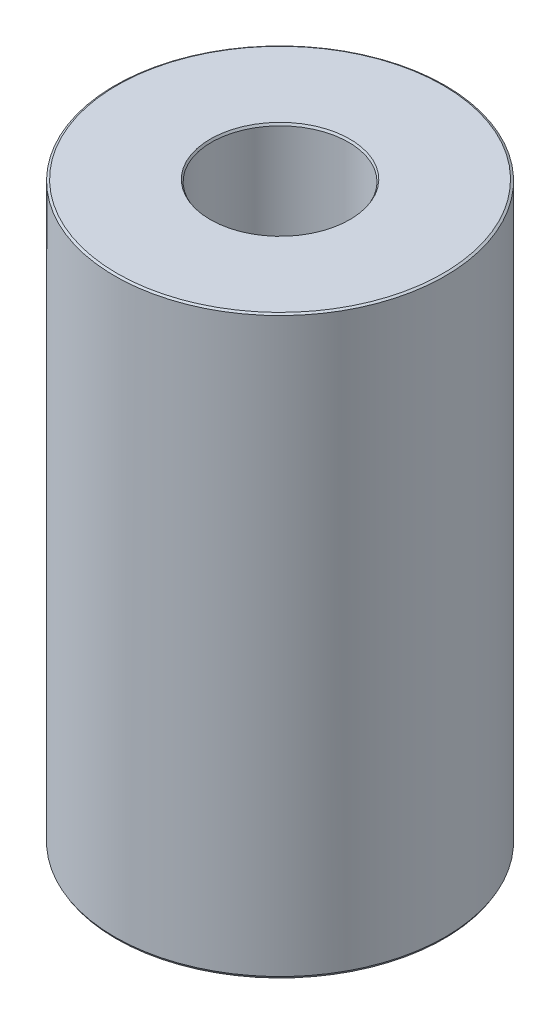
ISO-10303-21;
HEADER;
FILE_DESCRIPTION(('STEP AP214'),'2;1');
FILE_NAME('part.step','',(''),(''),'','','');
FILE_SCHEMA(('AUTOMOTIVE_DESIGN { 1 0 10303 214 1 1 1 1 }'));
ENDSEC;
DATA;
#1=APPLICATION_CONTEXT('core data for automotive mechanical design processes');
#2=APPLICATION_PROTOCOL_DEFINITION('international standard','automotive_design',2000,#1);
#3=PRODUCT_CONTEXT('',#1,'mechanical');
#4=PRODUCT('Part','Part','',(#3));
#5=PRODUCT_RELATED_PRODUCT_CATEGORY('part','',(#4));
#6=PRODUCT_DEFINITION_FORMATION('','',#4);
#7=PRODUCT_DEFINITION_CONTEXT('part definition',#1,'design');
#8=PRODUCT_DEFINITION('design','',#6,#7);
#9=PRODUCT_DEFINITION_SHAPE('','',#8);
#10=(LENGTH_UNIT() NAMED_UNIT(*) SI_UNIT(.MILLI.,.METRE.));
#11=(NAMED_UNIT(*) PLANE_ANGLE_UNIT() SI_UNIT($,.RADIAN.));
#12=(NAMED_UNIT(*) SI_UNIT($,.STERADIAN.) SOLID_ANGLE_UNIT());
#13=UNCERTAINTY_MEASURE_WITH_UNIT(LENGTH_MEASURE(1.E-05),#10,'distance_accuracy_value','');
#14=(GEOMETRIC_REPRESENTATION_CONTEXT(3) GLOBAL_UNCERTAINTY_ASSIGNED_CONTEXT((#13)) GLOBAL_UNIT_ASSIGNED_CONTEXT((#10,
#11,#12)) REPRESENTATION_CONTEXT('',''));
#15=CARTESIAN_POINT('',(0.,0.,0.));
#16=DIRECTION('',(0.,0.,1.));
#17=DIRECTION('',(1.,0.,0.));
#18=AXIS2_PLACEMENT_3D('',#15,#16,#17);
#19=CARTESIAN_POINT('',(0.,122.043287805677,0.));
#20=DIRECTION('',(0.,-1.,0.));
#21=DIRECTION('',(0.,0.,-1.));
#22=AXIS2_PLACEMENT_3D('',#19,#20,#21);
#23=CYLINDRICAL_SURFACE('',#22,35.);
#24=CARTESIAN_POINT('',(0.,0.454640372833229,0.));
#25=DIRECTION('',(0.,1.,0.));
#26=DIRECTION('',(0.,0.,1.));
#27=AXIS2_PLACEMENT_3D('',#24,#25,#26);
#28=CIRCLE('',#27,35.);
#29=CARTESIAN_POINT('',(0.,0.454640372833229,-35.));
#30=VERTEX_POINT('',#29);
#31=EDGE_CURVE('E10',#30,#30,#28,.T.);
#32=CARTESIAN_POINT('',(0.,121.780801064037,0.));
#33=DIRECTION('',(0.,1.,0.));
#34=DIRECTION('',(0.,0.,1.));
#35=AXIS2_PLACEMENT_3D('',#32,#33,#34);
#36=CIRCLE('',#35,35.);
#37=CARTESIAN_POINT('',(0.,121.780801064037,-35.));
#38=VERTEX_POINT('',#37);
#39=EDGE_CURVE('E50',#38,#38,#36,.F.);
#40=CARTESIAN_POINT('',(0.,0.454640372833229,-35.));
#41=CARTESIAN_POINT('',(0.,1.71845454669994,-35.));
#42=CARTESIAN_POINT('',(0.,2.98226872056665,-35.));
#43=CARTESIAN_POINT('',(0.,5.50989706830007,-35.));
#44=CARTESIAN_POINT('',(0.,6.77371124216678,-35.));
#45=CARTESIAN_POINT('',(0.,9.3013395899002,-35.));
#46=CARTESIAN_POINT('',(0.,10.5651537637669,-35.));
#47=CARTESIAN_POINT('',(0.,13.0927821115003,-35.));
#48=CARTESIAN_POINT('',(0.,14.356596285367,-35.));
#49=CARTESIAN_POINT('',(0.,16.8842246331005,-35.));
#50=CARTESIAN_POINT('',(0.,18.1480388069672,-35.));
#51=CARTESIAN_POINT('',(0.,20.6756671547006,-35.));
#52=CARTESIAN_POINT('',(0.,21.9394813285673,-35.));
#53=CARTESIAN_POINT('',(0.,24.4671096763007,-35.));
#54=CARTESIAN_POINT('',(0.,25.7309238501674,-35.));
#55=CARTESIAN_POINT('',(0.,28.2585521979009,-35.));
#56=CARTESIAN_POINT('',(0.,29.5223663717676,-35.));
#57=CARTESIAN_POINT('',(0.,32.049994719501,-35.));
#58=CARTESIAN_POINT('',(0.,33.3138088933677,-35.));
#59=CARTESIAN_POINT('',(0.,35.8414372411011,-35.));
#60=CARTESIAN_POINT('',(0.,37.1052514149678,-35.));
#61=CARTESIAN_POINT('',(0.,39.6328797627013,-35.));
#62=CARTESIAN_POINT('',(0.,40.896693936568,-35.));
#63=CARTESIAN_POINT('',(0.,43.4243222843014,-35.));
#64=CARTESIAN_POINT('',(0.,44.6881364581681,-35.));
#65=CARTESIAN_POINT('',(0.,47.2157648059015,-35.));
#66=CARTESIAN_POINT('',(0.,48.4795789797682,-35.));
#67=CARTESIAN_POINT('',(0.,51.0072073275017,-35.));
#68=CARTESIAN_POINT('',(0.,52.2710215013684,-35.));
#69=CARTESIAN_POINT('',(0.,54.7986498491018,-35.));
#70=CARTESIAN_POINT('',(0.,56.0624640229685,-35.));
#71=CARTESIAN_POINT('',(0.,58.5900923707019,-35.));
#72=CARTESIAN_POINT('',(0.,59.8539065445686,-35.));
#73=CARTESIAN_POINT('',(0.,62.381534892302,-35.));
#74=CARTESIAN_POINT('',(0.,63.6453490661688,-35.));
#75=CARTESIAN_POINT('',(0.,66.1729774139022,-35.));
#76=CARTESIAN_POINT('',(0.,67.4367915877689,-35.));
#77=CARTESIAN_POINT('',(0.,69.9644199355023,-35.));
#78=CARTESIAN_POINT('',(0.,71.228234109369,-35.));
#79=CARTESIAN_POINT('',(0.,73.7558624571024,-35.));
#80=CARTESIAN_POINT('',(0.,75.0196766309691,-35.));
#81=CARTESIAN_POINT('',(0.,77.5473049787026,-35.));
#82=CARTESIAN_POINT('',(0.,78.8111191525693,-35.));
#83=CARTESIAN_POINT('',(0.,81.3387475003027,-35.));
#84=CARTESIAN_POINT('',(0.,82.6025616741694,-35.));
#85=CARTESIAN_POINT('',(0.,85.1301900219028,-35.));
#86=CARTESIAN_POINT('',(0.,86.3940041957696,-35.));
#87=CARTESIAN_POINT('',(0.,88.921632543503,-35.));
#88=CARTESIAN_POINT('',(0.,90.1854467173697,-35.));
#89=CARTESIAN_POINT('',(0.,92.7130750651031,-35.));
#90=CARTESIAN_POINT('',(0.,93.9768892389698,-35.));
#91=CARTESIAN_POINT('',(0.,96.5045175867032,-35.));
#92=CARTESIAN_POINT('',(0.,97.7683317605699,-35.));
#93=CARTESIAN_POINT('',(0.,100.295960108303,-35.));
#94=CARTESIAN_POINT('',(0.,101.55977428217,-35.));
#95=CARTESIAN_POINT('',(0.,104.087402629903,-35.));
#96=CARTESIAN_POINT('',(0.,105.35121680377,-35.));
#97=CARTESIAN_POINT('',(0.,107.878845151504,-35.));
#98=CARTESIAN_POINT('',(0.,109.14265932537,-35.));
#99=CARTESIAN_POINT('',(0.,111.670287673104,-35.));
#100=CARTESIAN_POINT('',(0.,112.93410184697,-35.));
#101=CARTESIAN_POINT('',(0.,115.461730194704,-35.));
#102=CARTESIAN_POINT('',(0.,116.725544368571,-35.));
#103=CARTESIAN_POINT('',(0.,119.253172716304,-35.));
#104=CARTESIAN_POINT('',(0.,120.516986890171,-35.));
#105=CARTESIAN_POINT('',(0.,121.780801064037,-35.));
#106=B_SPLINE_CURVE_WITH_KNOTS('',3,(#40,#41,#42,#43,#44,#45,#46,#47,#48,#49,#50,#51,#52,#53,
#54,#55,#56,#57,#58,#59,#60,#61,#62,#63,#64,#65,#66,#67,#68,#69,#70,#71,#72,#73,#74,#75,#76,#77,
#78,#79,#80,#81,#82,#83,#84,#85,#86,#87,#88,#89,#90,#91,#92,#93,#94,#95,#96,#97,#98,#99,#100,
#101,#102,#103,#104,#105),.UNSPECIFIED.,.F.,.F.,(4,2,2,2,2,2,2,2,2,2,2,2,2,2,2,2,2,2,2,2,2,2,2,
2,2,2,2,2,2,2,2,2,4),(0.,3.79144252160013,7.58288504320026,11.3743275648004,15.1657700864005,
18.9572126080007,22.7486551296008,26.5400976512009,30.3315401728011,34.1229826944012,
37.9144252160013,41.7058677376015,45.4973102592016,49.2887527808017,53.0801953024018,
56.871637824002,60.6630803456021,64.4545228672022,68.2459653888024,72.0374079104025,
75.8288504320026,79.6202929536028,83.4117354752029,87.203177996803,90.9946205184032,
94.7860630400033,98.5775055616034,102.368948083204,106.160390604804,109.951833126404,
113.743275648004,117.534718169604,121.326160691204),.UNSPECIFIED.);
#107=EDGE_CURVE('BSEAM39',#30,#38,#106,.T.);
#108=ORIENTED_EDGE('',*,*,#31,.T.);
#109=ORIENTED_EDGE('',*,*,#39,.T.);
#110=ORIENTED_EDGE('',*,*,#107,.T.);
#111=ORIENTED_EDGE('',*,*,#107,.F.);
#112=EDGE_LOOP('',(#108,#110,#109,#111));
#113=FACE_BOUND('',#112,.T.);
#114=ADVANCED_FACE('F39',(#113),#23,.T.);
#115=CARTESIAN_POINT('',(0.,122.043287805677,0.));
#116=DIRECTION('',(0.,1.,0.));
#117=DIRECTION('',(0.,0.,1.));
#118=AXIS2_PLACEMENT_3D('',#115,#116,#117);
#119=PLANE('',#118);
#120=CARTESIAN_POINT('',(0.,122.043287805677,0.));
#121=DIRECTION('',(0.,1.,0.));
#122=DIRECTION('',(0.,0.,1.));
#123=AXIS2_PLACEMENT_3D('',#120,#121,#122);
#124=CIRCLE('',#123,14.7996415583158);
#125=CARTESIAN_POINT('',(0.,122.043287805677,14.7996415583158));
#126=VERTEX_POINT('',#125);
#127=EDGE_CURVE('E58',#126,#126,#124,.F.);
#128=ORIENTED_EDGE('',*,*,#127,.T.);
#129=EDGE_LOOP('',(#128));
#130=FACE_BOUND('',#129,.T.);
#131=CARTESIAN_POINT('',(0.,122.043287805677,0.));
#132=DIRECTION('',(0.,1.,0.));
#133=DIRECTION('',(0.,0.,1.));
#134=AXIS2_PLACEMENT_3D('',#131,#132,#133);
#135=CIRCLE('',#134,34.5453596271668);
#136=CARTESIAN_POINT('',(0.,122.043287805677,-34.5453596271668));
#137=VERTEX_POINT('',#136);
#138=EDGE_CURVE('E61',#137,#137,#135,.T.);
#139=ORIENTED_EDGE('',*,*,#138,.T.);
#140=EDGE_LOOP('',(#139));
#141=FACE_BOUND('',#140,.T.);
#142=ADVANCED_FACE('F88',(#130,#141),#119,.T.);
#143=CARTESIAN_POINT('',(0.,0.,0.));
#144=DIRECTION('',(0.,1.,0.));
#145=DIRECTION('',(0.,0.,1.));
#146=AXIS2_PLACEMENT_3D('',#143,#144,#145);
#147=PLANE('',#146);
#148=CARTESIAN_POINT('',(0.,0.,0.));
#149=DIRECTION('',(0.,1.,0.));
#150=DIRECTION('',(0.,0.,1.));
#151=AXIS2_PLACEMENT_3D('',#148,#149,#150);
#152=CIRCLE('',#151,14.9917951895093);
#153=CARTESIAN_POINT('',(0.,0.,14.9917951895093));
#154=VERTEX_POINT('',#153);
#155=EDGE_CURVE('E51',#154,#154,#152,.T.);
#156=ORIENTED_EDGE('',*,*,#155,.T.);
#157=EDGE_LOOP('',(#156));
#158=FACE_BOUND('',#157,.T.);
#159=CARTESIAN_POINT('',(0.,0.,0.));
#160=DIRECTION('',(0.,1.,0.));
#161=DIRECTION('',(0.,0.,1.));
#162=AXIS2_PLACEMENT_3D('',#159,#160,#161);
#163=CIRCLE('',#162,34.7375132583603);
#164=CARTESIAN_POINT('',(0.,0.,34.7375132583603));
#165=VERTEX_POINT('',#164);
#166=EDGE_CURVE('E54',#165,#165,#163,.F.);
#167=ORIENTED_EDGE('',*,*,#166,.T.);
#168=EDGE_LOOP('',(#167));
#169=FACE_BOUND('',#168,.T.);
#170=ADVANCED_FACE('F83',(#158,#169),#147,.F.);
#171=CARTESIAN_POINT('',(0.,122.043287805677,0.));
#172=DIRECTION('',(0.,-1.,0.));
#173=DIRECTION('',(0.,0.,-1.));
#174=AXIS2_PLACEMENT_3D('',#171,#172,#173);
#175=CYLINDRICAL_SURFACE('',#174,14.5371548166761);
#176=CARTESIAN_POINT('',(0.,121.588647432844,0.));
#177=DIRECTION('',(0.,1.,0.));
#178=DIRECTION('',(0.,0.,1.));
#179=AXIS2_PLACEMENT_3D('',#176,#177,#178);
#180=CIRCLE('',#179,14.5371548166761);
#181=CARTESIAN_POINT('',(0.,121.588647432844,14.5371548166761));
#182=VERTEX_POINT('',#181);
#183=EDGE_CURVE('E67',#182,#182,#180,.T.);
#184=ORIENTED_EDGE('',*,*,#183,.T.);
#185=EDGE_LOOP('',(#184));
#186=FACE_BOUND('',#185,.T.);
#187=CARTESIAN_POINT('',(0.,0.26248674163977,0.));
#188=DIRECTION('',(0.,1.,0.));
#189=DIRECTION('',(0.,0.,1.));
#190=AXIS2_PLACEMENT_3D('',#187,#188,#189);
#191=CIRCLE('',#190,14.5371548166761);
#192=CARTESIAN_POINT('',(0.,0.26248674163977,14.5371548166761));
#193=VERTEX_POINT('',#192);
#194=EDGE_CURVE('E69',#193,#193,#191,.F.);
#195=ORIENTED_EDGE('',*,*,#194,.T.);
#196=EDGE_LOOP('',(#195));
#197=FACE_BOUND('',#196,.T.);
#198=ADVANCED_FACE('F71',(#186,#197),#175,.F.);
#199=CARTESIAN_POINT('',(0.,121.588647432844,0.));
#200=DIRECTION('',(0.,1.,0.));
#201=DIRECTION('',(0.,0.,1.));
#202=AXIS2_PLACEMENT_3D('',#199,#200,#201);
#203=CONICAL_SURFACE('',#202,14.5371548166761,0.523598775598273);
#204=ORIENTED_EDGE('',*,*,#127,.F.);
#205=EDGE_LOOP('',(#204));
#206=FACE_BOUND('',#205,.T.);
#207=ORIENTED_EDGE('',*,*,#183,.F.);
#208=EDGE_LOOP('',(#207));
#209=FACE_BOUND('',#208,.T.);
#210=ADVANCED_FACE('F77',(#206,#209),#203,.F.);
#211=CARTESIAN_POINT('',(0.,0.,0.));
#212=DIRECTION('',(0.,-1.,0.));
#213=DIRECTION('',(0.,0.,-1.));
#214=AXIS2_PLACEMENT_3D('',#211,#212,#213);
#215=CONICAL_SURFACE('',#214,14.9917951895093,1.0471975511966);
#216=ORIENTED_EDGE('',*,*,#194,.F.);
#217=EDGE_LOOP('',(#216));
#218=FACE_BOUND('',#217,.T.);
#219=ORIENTED_EDGE('',*,*,#155,.F.);
#220=EDGE_LOOP('',(#219));
#221=FACE_BOUND('',#220,.T.);
#222=ADVANCED_FACE('F73',(#218,#221),#215,.F.);
#223=CARTESIAN_POINT('',(0.,0.454640372833229,0.));
#224=DIRECTION('',(0.,1.,0.));
#225=DIRECTION('',(0.,0.,1.));
#226=AXIS2_PLACEMENT_3D('',#223,#224,#225);
#227=CONICAL_SURFACE('',#226,35.,0.523598775598296);
#228=ORIENTED_EDGE('',*,*,#166,.F.);
#229=EDGE_LOOP('',(#228));
#230=FACE_BOUND('',#229,.T.);
#231=ORIENTED_EDGE('',*,*,#31,.F.);
#232=EDGE_LOOP('',(#231));
#233=FACE_BOUND('',#232,.T.);
#234=ADVANCED_FACE('F76',(#230,#233),#227,.T.);
#235=CARTESIAN_POINT('',(0.,122.043287805677,0.));
#236=DIRECTION('',(0.,-1.,0.));
#237=DIRECTION('',(0.,0.,-1.));
#238=AXIS2_PLACEMENT_3D('',#235,#236,#237);
#239=CONICAL_SURFACE('',#238,34.5453596271668,1.04719755119663);
#240=CARTESIAN_POINT('',(0.,121.780801064037,-35.));
#241=CARTESIAN_POINT('',(0.,121.78353530093,-34.995264162783));
#242=CARTESIAN_POINT('',(0.,121.786269537822,-34.990528325566));
#243=CARTESIAN_POINT('',(0.,121.791738011606,-34.981056651132));
#244=CARTESIAN_POINT('',(0.,121.794472248498,-34.976320813915));
#245=CARTESIAN_POINT('',(0.,121.799940722282,-34.9668491394809));
#246=CARTESIAN_POINT('',(0.,121.802674959174,-34.9621133022639));
#247=CARTESIAN_POINT('',(0.,121.808143432958,-34.9526416278299));
#248=CARTESIAN_POINT('',(0.,121.81087766985,-34.9479057906129));
#249=CARTESIAN_POINT('',(0.,121.816346143634,-34.9384341161789));
#250=CARTESIAN_POINT('',(0.,121.819080380527,-34.9336982789618));
#251=CARTESIAN_POINT('',(0.,121.824548854311,-34.9242266045278));
#252=CARTESIAN_POINT('',(0.,121.827283091203,-34.9194907673108));
#253=CARTESIAN_POINT('',(0.,121.832751564987,-34.9100190928768));
#254=CARTESIAN_POINT('',(0.,121.835485801879,-34.9052832556598));
#255=CARTESIAN_POINT('',(0.,121.840954275663,-34.8958115812257));
#256=CARTESIAN_POINT('',(0.,121.843688512555,-34.8910757440087));
#257=CARTESIAN_POINT('',(0.,121.849156986339,-34.8816040695747));
#258=CARTESIAN_POINT('',(0.,121.851891223232,-34.8768682323577));
#259=CARTESIAN_POINT('',(0.,121.857359697016,-34.8673965579237));
#260=CARTESIAN_POINT('',(0.,121.860093933908,-34.8626607207066));
#261=CARTESIAN_POINT('',(0.,121.865562407692,-34.8531890462726));
#262=CARTESIAN_POINT('',(0.,121.868296644584,-34.8484532090556));
#263=CARTESIAN_POINT('',(0.,121.873765118368,-34.8389815346216));
#264=CARTESIAN_POINT('',(0.,121.87649935526,-34.8342456974046));
#265=CARTESIAN_POINT('',(0.,121.881967829044,-34.8247740229705));
#266=CARTESIAN_POINT('',(0.,121.884702065937,-34.8200381857535));
#267=CARTESIAN_POINT('',(0.,121.890170539721,-34.8105665113195));
#268=CARTESIAN_POINT('',(0.,121.892904776613,-34.8058306741025));
#269=CARTESIAN_POINT('',(0.,121.898373250397,-34.7963589996685));
#270=CARTESIAN_POINT('',(0.,121.901107487289,-34.7916231624515));
#271=CARTESIAN_POINT('',(0.,121.906575961073,-34.7821514880174));
#272=CARTESIAN_POINT('',(0.,121.909310197965,-34.7774156508004));
#273=CARTESIAN_POINT('',(0.,121.914778671749,-34.7679439763664));
#274=CARTESIAN_POINT('',(0.,121.917512908641,-34.7632081391494));
#275=CARTESIAN_POINT('',(0.,121.922981382426,-34.7537364647153));
#276=CARTESIAN_POINT('',(0.,121.925715619318,-34.7490006274983));
#277=CARTESIAN_POINT('',(0.,121.931184093102,-34.7395289530643));
#278=CARTESIAN_POINT('',(0.,121.933918329994,-34.7347931158473));
#279=CARTESIAN_POINT('',(0.,121.939386803778,-34.7253214414133));
#280=CARTESIAN_POINT('',(0.,121.94212104067,-34.7205856041963));
#281=CARTESIAN_POINT('',(0.,121.947589514454,-34.7111139297622));
#282=CARTESIAN_POINT('',(0.,121.950323751346,-34.7063780925452));
#283=CARTESIAN_POINT('',(0.,121.955792225131,-34.6969064181112));
#284=CARTESIAN_POINT('',(0.,121.958526462023,-34.6921705808942));
#285=CARTESIAN_POINT('',(0.,121.963994935807,-34.6826989064602));
#286=CARTESIAN_POINT('',(0.,121.966729172699,-34.6779630692431));
#287=CARTESIAN_POINT('',(0.,121.972197646483,-34.6684913948091));
#288=CARTESIAN_POINT('',(0.,121.974931883375,-34.6637555575921));
#289=CARTESIAN_POINT('',(0.,121.980400357159,-34.6542838831581));
#290=CARTESIAN_POINT('',(0.,121.983134594051,-34.6495480459411));
#291=CARTESIAN_POINT('',(0.,121.988603067836,-34.640076371507));
#292=CARTESIAN_POINT('',(0.,121.991337304728,-34.63534053429));
#293=CARTESIAN_POINT('',(0.,121.996805778512,-34.625868859856));
#294=CARTESIAN_POINT('',(0.,121.999540015404,-34.621133022639));
#295=CARTESIAN_POINT('',(0.,122.005008489188,-34.611661348205));
#296=CARTESIAN_POINT('',(0.,122.00774272608,-34.6069255109879));
#297=CARTESIAN_POINT('',(0.,122.013211199864,-34.5974538365539));
#298=CARTESIAN_POINT('',(0.,122.015945436756,-34.5927179993369));
#299=CARTESIAN_POINT('',(0.,122.021413910541,-34.5832463249029));
#300=CARTESIAN_POINT('',(0.,122.024148147433,-34.5785104876859));
#301=CARTESIAN_POINT('',(0.,122.029616621217,-34.5690388132518));
#302=CARTESIAN_POINT('',(0.,122.032350858109,-34.5643029760348));
#303=CARTESIAN_POINT('',(0.,122.037819331893,-34.5548313016008));
#304=CARTESIAN_POINT('',(0.,122.040553568785,-34.5500954643838));
#305=CARTESIAN_POINT('',(0.,122.043287805677,-34.5453596271668));
#306=B_SPLINE_CURVE_WITH_KNOTS('',3,(#240,#241,#242,#243,#244,#245,#246,#247,#248,#249,#250,
#251,#252,#253,#254,#255,#256,#257,#258,#259,#260,#261,#262,#263,#264,#265,#266,#267,#268,#269,
#270,#271,#272,#273,#274,#275,#276,#277,#278,#279,#280,#281,#282,#283,#284,#285,#286,#287,#288,
#289,#290,#291,#292,#293,#294,#295,#296,#297,#298,#299,#300,#301,#302,#303,#304,#305),
.UNSPECIFIED.,.F.,.F.,(4,2,2,2,2,2,2,2,2,2,2,2,2,2,2,2,2,2,2,2,2,2,2,2,2,2,2,2,2,2,2,2,4),(0.,
0.0164054213524862,0.0328108427049664,0.0492162640574467,0.0656216854099329,0.0820271067624131,
0.0984325281149063,0.114837949467386,0.131243370819873,0.147648792172353,0.164054213524833,
0.180459634877326,0.196865056229807,0.213270477582293,0.229675898934773,0.246081320287253,
0.262486741639746,0.278892162992227,0.295297584344713,0.311703005697193,0.328108427049673,
0.34451384840216,0.360919269754647,0.377324691107133,0.393730112459613,0.410135533812093,
0.42654095516458,0.442946376517067,0.459351797869553,0.475757219222033,0.492162640574513,
0.508568061927,0.524973483279487),.UNSPECIFIED.);
#307=EDGE_CURVE('BSEAM45',#38,#137,#306,.T.);
#308=ORIENTED_EDGE('',*,*,#39,.F.);
#309=ORIENTED_EDGE('',*,*,#138,.F.);
#310=ORIENTED_EDGE('',*,*,#307,.T.);
#311=ORIENTED_EDGE('',*,*,#307,.F.);
#312=EDGE_LOOP('',(#308,#310,#309,#311));
#313=FACE_BOUND('',#312,.T.);
#314=ADVANCED_FACE('F45',(#313),#239,.T.);
#315=CLOSED_SHELL('',(#114,#142,#170,#198,#210,#222,#234,#314));
#316=MANIFOLD_SOLID_BREP('B2',#315);
#317=ADVANCED_BREP_SHAPE_REPRESENTATION('',(#18,#316),#14);
#318=SHAPE_DEFINITION_REPRESENTATION(#9,#317);
ENDSEC;
END-ISO-10303-21;
